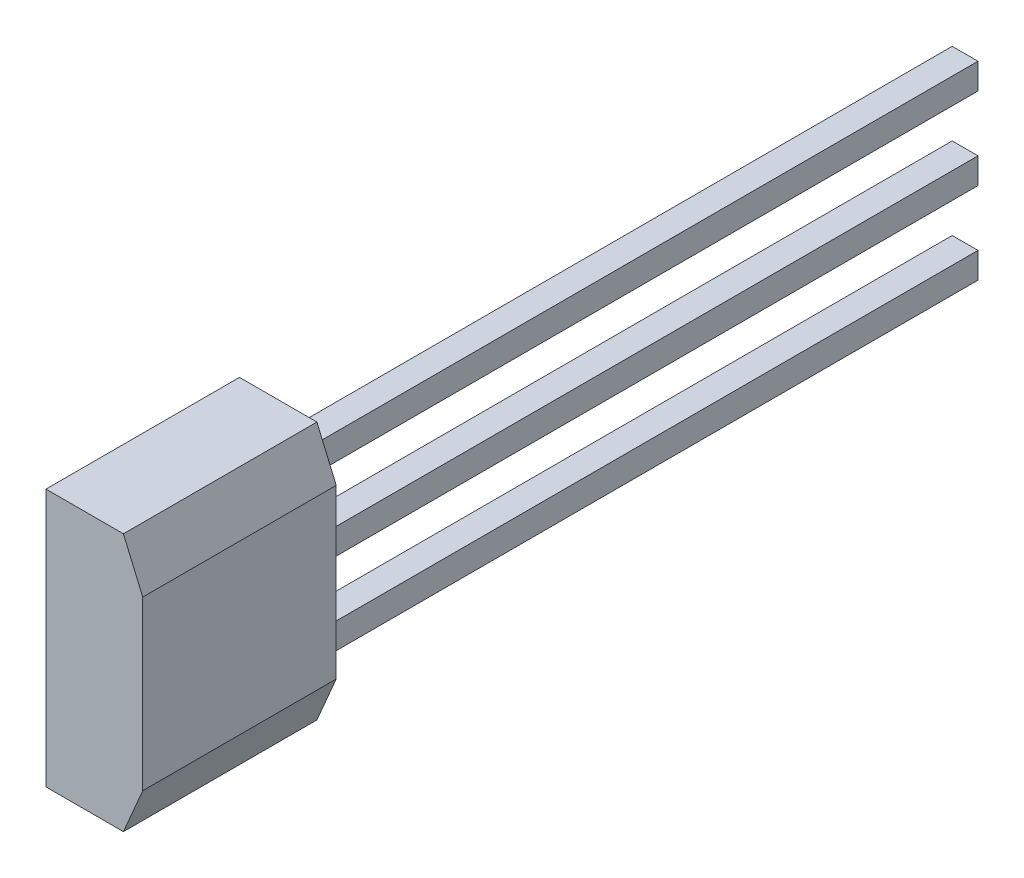
ISO-10303-21;
HEADER;
FILE_DESCRIPTION(('STEP AP214'),'2;1');
FILE_NAME('part.step','',(''),(''),'','','');
FILE_SCHEMA(('AUTOMOTIVE_DESIGN { 1 0 10303 214 1 1 1 1 }'));
ENDSEC;
DATA;
#1=APPLICATION_CONTEXT('core data for automotive mechanical design processes');
#2=APPLICATION_PROTOCOL_DEFINITION('international standard','automotive_design',2000,#1);
#3=PRODUCT_CONTEXT('',#1,'mechanical');
#4=PRODUCT('Part','Part','',(#3));
#5=PRODUCT_RELATED_PRODUCT_CATEGORY('part','',(#4));
#6=PRODUCT_DEFINITION_FORMATION('','',#4);
#7=PRODUCT_DEFINITION_CONTEXT('part definition',#1,'design');
#8=PRODUCT_DEFINITION('design','',#6,#7);
#9=PRODUCT_DEFINITION_SHAPE('','',#8);
#10=(LENGTH_UNIT() NAMED_UNIT(*) SI_UNIT(.MILLI.,.METRE.));
#11=(NAMED_UNIT(*) PLANE_ANGLE_UNIT() SI_UNIT($,.RADIAN.));
#12=(NAMED_UNIT(*) SI_UNIT($,.STERADIAN.) SOLID_ANGLE_UNIT());
#13=UNCERTAINTY_MEASURE_WITH_UNIT(LENGTH_MEASURE(1.E-05),#10,'distance_accuracy_value','');
#14=(GEOMETRIC_REPRESENTATION_CONTEXT(3) GLOBAL_UNCERTAINTY_ASSIGNED_CONTEXT((#13)) GLOBAL_UNIT_ASSIGNED_CONTEXT((#10,
#11,#12)) REPRESENTATION_CONTEXT('',''));
#15=CARTESIAN_POINT('',(0.,0.,0.));
#16=DIRECTION('',(0.,0.,1.));
#17=DIRECTION('',(1.,0.,0.));
#18=AXIS2_PLACEMENT_3D('',#15,#16,#17);
#19=CARTESIAN_POINT('',(-0.2,-10.71699176271,2.21));
#20=DIRECTION('',(-1.,0.,0.));
#21=DIRECTION('',(0.,1.,0.));
#22=AXIS2_PLACEMENT_3D('',#19,#20,#21);
#23=PLANE('',#22);
#24=DIRECTION('',(0.,1.,0.));
#25=VECTOR('',#24,1.);
#26=CARTESIAN_POINT('',(-0.2,-10.5,-8.5));
#27=LINE('',#26,#25);
#28=CARTESIAN_POINT('',(-0.2,-10.7,-8.5));
#29=VERTEX_POINT('',#28);
#30=CARTESIAN_POINT('',(-0.199999999999998,-10.3,-8.5));
#31=VERTEX_POINT('',#30);
#32=EDGE_CURVE('E224',#29,#31,#27,.T.);
#33=ORIENTED_EDGE('',*,*,#32,.F.);
#34=DIRECTION('',(0.,0.,-1.));
#35=VECTOR('',#34,1.);
#36=CARTESIAN_POINT('',(-0.200000000000001,-10.7,-3.25));
#37=LINE('',#36,#35);
#38=CARTESIAN_POINT('',(-0.2,-10.7,2.));
#39=VERTEX_POINT('',#38);
#40=EDGE_CURVE('E217',#39,#29,#37,.T.);
#41=ORIENTED_EDGE('',*,*,#40,.F.);
#42=DIRECTION('',(0.,1.,0.));
#43=VECTOR('',#42,1.);
#44=CARTESIAN_POINT('',(-0.2,-10.5,2.));
#45=LINE('',#44,#43);
#46=CARTESIAN_POINT('',(-0.199999999999998,-10.3,2.));
#47=VERTEX_POINT('',#46);
#48=EDGE_CURVE('E201',#39,#47,#45,.T.);
#49=ORIENTED_EDGE('',*,*,#48,.T.);
#50=DIRECTION('',(0.,0.,1.));
#51=VECTOR('',#50,1.);
#52=CARTESIAN_POINT('',(-0.19999999999999,-10.3,-3.25));
#53=LINE('',#52,#51);
#54=EDGE_CURVE('E233',#31,#47,#53,.T.);
#55=ORIENTED_EDGE('',*,*,#54,.F.);
#56=EDGE_LOOP('',(#33,#41,#49,#55));
#57=FACE_BOUND('',#56,.T.);
#58=ADVANCED_FACE('F17',(#57),#23,.T.);
#59=CARTESIAN_POINT('',(-0.2,-9.44699176271,2.21));
#60=DIRECTION('',(-1.,0.,0.));
#61=DIRECTION('',(0.,1.,0.));
#62=AXIS2_PLACEMENT_3D('',#59,#60,#61);
#63=PLANE('',#62);
#64=DIRECTION('',(0.,1.,0.));
#65=VECTOR('',#64,1.);
#66=CARTESIAN_POINT('',(-0.2,-10.5,-8.5));
#67=LINE('',#66,#65);
#68=CARTESIAN_POINT('',(-0.2,-9.42999999999995,-8.5));
#69=VERTEX_POINT('',#68);
#70=CARTESIAN_POINT('',(-0.199999999999998,-9.03000000000005,-8.5));
#71=VERTEX_POINT('',#70);
#72=EDGE_CURVE('E248',#69,#71,#67,.T.);
#73=ORIENTED_EDGE('',*,*,#72,.F.);
#74=DIRECTION('',(0.,0.,-1.));
#75=VECTOR('',#74,1.);
#76=CARTESIAN_POINT('',(-0.200000000000001,-9.43,-3.25));
#77=LINE('',#76,#75);
#78=CARTESIAN_POINT('',(-0.2,-9.42999999999995,2.));
#79=VERTEX_POINT('',#78);
#80=EDGE_CURVE('E241',#79,#69,#77,.T.);
#81=ORIENTED_EDGE('',*,*,#80,.F.);
#82=DIRECTION('',(0.,1.,0.));
#83=VECTOR('',#82,1.);
#84=CARTESIAN_POINT('',(-0.2,-9.23,2.));
#85=LINE('',#84,#83);
#86=CARTESIAN_POINT('',(-0.199999999999998,-9.03000000000005,2.));
#87=VERTEX_POINT('',#86);
#88=EDGE_CURVE('E205',#79,#87,#85,.T.);
#89=ORIENTED_EDGE('',*,*,#88,.T.);
#90=DIRECTION('',(0.,0.,1.));
#91=VECTOR('',#90,1.);
#92=CARTESIAN_POINT('',(-0.19999999999999,-9.03,-3.25));
#93=LINE('',#92,#91);
#94=EDGE_CURVE('E258',#71,#87,#93,.T.);
#95=ORIENTED_EDGE('',*,*,#94,.F.);
#96=EDGE_LOOP('',(#73,#81,#89,#95));
#97=FACE_BOUND('',#96,.T.);
#98=ADVANCED_FACE('F563',(#97),#63,.T.);
#99=CARTESIAN_POINT('',(-0.2,-11.98699176271,2.21));
#100=DIRECTION('',(-1.,0.,0.));
#101=DIRECTION('',(0.,1.,0.));
#102=AXIS2_PLACEMENT_3D('',#99,#100,#101);
#103=PLANE('',#102);
#104=DIRECTION('',(0.,1.,0.));
#105=VECTOR('',#104,1.);
#106=CARTESIAN_POINT('',(-0.2,-10.5,-8.5));
#107=LINE('',#106,#105);
#108=CARTESIAN_POINT('',(-0.2,-11.97,-8.5));
#109=VERTEX_POINT('',#108);
#110=CARTESIAN_POINT('',(-0.199999999999998,-11.57,-8.5));
#111=VERTEX_POINT('',#110);
#112=EDGE_CURVE('E272',#109,#111,#107,.T.);
#113=ORIENTED_EDGE('',*,*,#112,.F.);
#114=DIRECTION('',(0.,0.,-1.));
#115=VECTOR('',#114,1.);
#116=CARTESIAN_POINT('',(-0.200000000000001,-11.97,-3.25));
#117=LINE('',#116,#115);
#118=CARTESIAN_POINT('',(-0.2,-11.97,2.));
#119=VERTEX_POINT('',#118);
#120=EDGE_CURVE('E266',#119,#109,#117,.T.);
#121=ORIENTED_EDGE('',*,*,#120,.F.);
#122=DIRECTION('',(0.,1.,0.));
#123=VECTOR('',#122,1.);
#124=CARTESIAN_POINT('',(-0.2,-11.77,2.));
#125=LINE('',#124,#123);
#126=CARTESIAN_POINT('',(-0.199999999999998,-11.57,2.));
#127=VERTEX_POINT('',#126);
#128=EDGE_CURVE('E209',#119,#127,#125,.T.);
#129=ORIENTED_EDGE('',*,*,#128,.T.);
#130=DIRECTION('',(0.,0.,1.));
#131=VECTOR('',#130,1.);
#132=CARTESIAN_POINT('',(-0.19999999999999,-11.57,-3.25));
#133=LINE('',#132,#131);
#134=EDGE_CURVE('E282',#111,#127,#133,.T.);
#135=ORIENTED_EDGE('',*,*,#134,.F.);
#136=EDGE_LOOP('',(#113,#121,#129,#135));
#137=FACE_BOUND('',#136,.T.);
#138=ADVANCED_FACE('F553',(#137),#103,.T.);
#139=CARTESIAN_POINT('',(0.2169917627102,-10.7,2.21));
#140=DIRECTION('',(0.,-1.,0.));
#141=DIRECTION('',(-1.,0.,0.));
#142=AXIS2_PLACEMENT_3D('',#139,#140,#141);
#143=PLANE('',#142);
#144=DIRECTION('',(-1.,0.,0.));
#145=VECTOR('',#144,1.);
#146=CARTESIAN_POINT('',(0.,-10.7,-8.5));
#147=LINE('',#146,#145);
#148=CARTESIAN_POINT('',(0.199999999999995,-10.7,-8.5));
#149=VERTEX_POINT('',#148);
#150=EDGE_CURVE('E220',#149,#29,#147,.T.);
#151=ORIENTED_EDGE('',*,*,#150,.F.);
#152=DIRECTION('',(0.,0.,-1.));
#153=VECTOR('',#152,1.);
#154=CARTESIAN_POINT('',(0.2,-10.6999999999998,-3.25));
#155=LINE('',#154,#153);
#156=CARTESIAN_POINT('',(0.199999999999995,-10.7,2.));
#157=VERTEX_POINT('',#156);
#158=EDGE_CURVE('E286',#157,#149,#155,.T.);
#159=ORIENTED_EDGE('',*,*,#158,.F.);
#160=DIRECTION('',(-1.,0.,0.));
#161=VECTOR('',#160,1.);
#162=CARTESIAN_POINT('',(0.,-10.7,2.));
#163=LINE('',#162,#161);
#164=EDGE_CURVE('E213',#157,#39,#163,.T.);
#165=ORIENTED_EDGE('',*,*,#164,.T.);
#166=ORIENTED_EDGE('',*,*,#40,.T.);
#167=EDGE_LOOP('',(#151,#159,#165,#166));
#168=FACE_BOUND('',#167,.T.);
#169=ADVANCED_FACE('F543',(#168),#143,.T.);
#170=CARTESIAN_POINT('',(0.2169917627102,-12.0288,-8.5));
#171=DIRECTION('',(0.,0.,-1.));
#172=DIRECTION('',(-1.,0.,0.));
#173=AXIS2_PLACEMENT_3D('',#170,#171,#172);
#174=PLANE('',#173);
#175=DIRECTION('',(-1.,0.,0.));
#176=VECTOR('',#175,1.);
#177=CARTESIAN_POINT('',(0.,-10.3,-8.5));
#178=LINE('',#177,#176);
#179=CARTESIAN_POINT('',(0.2,-10.3,-8.5));
#180=VERTEX_POINT('',#179);
#181=EDGE_CURVE('E229',#180,#31,#178,.T.);
#182=ORIENTED_EDGE('',*,*,#181,.F.);
#183=DIRECTION('',(0.,1.,0.));
#184=VECTOR('',#183,1.);
#185=CARTESIAN_POINT('',(0.2,-10.5,-8.5));
#186=LINE('',#185,#184);
#187=EDGE_CURVE('E290',#149,#180,#186,.T.);
#188=ORIENTED_EDGE('',*,*,#187,.F.);
#189=ORIENTED_EDGE('',*,*,#150,.T.);
#190=ORIENTED_EDGE('',*,*,#32,.T.);
#191=EDGE_LOOP('',(#182,#188,#189,#190));
#192=FACE_BOUND('',#191,.T.);
#193=ADVANCED_FACE('F533',(#192),#174,.T.);
#194=CARTESIAN_POINT('',(-0.2169917627102,-10.3,2.21));
#195=DIRECTION('',(0.,1.,0.));
#196=DIRECTION('',(1.,0.,0.));
#197=AXIS2_PLACEMENT_3D('',#194,#195,#196);
#198=PLANE('',#197);
#199=ORIENTED_EDGE('',*,*,#181,.T.);
#200=ORIENTED_EDGE('',*,*,#54,.T.);
#201=DIRECTION('',(1.,0.,0.));
#202=VECTOR('',#201,1.);
#203=CARTESIAN_POINT('',(0.,-10.3,2.));
#204=LINE('',#203,#202);
#205=CARTESIAN_POINT('',(0.2,-10.3,2.));
#206=VERTEX_POINT('',#205);
#207=EDGE_CURVE('E227',#47,#206,#204,.T.);
#208=ORIENTED_EDGE('',*,*,#207,.T.);
#209=DIRECTION('',(0.,0.,1.));
#210=VECTOR('',#209,1.);
#211=CARTESIAN_POINT('',(0.2,-10.3000000000002,-3.25));
#212=LINE('',#211,#210);
#213=EDGE_CURVE('E294',#180,#206,#212,.T.);
#214=ORIENTED_EDGE('',*,*,#213,.F.);
#215=EDGE_LOOP('',(#199,#200,#208,#214));
#216=FACE_BOUND('',#215,.T.);
#217=ADVANCED_FACE('F523',(#216),#198,.T.);
#218=CARTESIAN_POINT('',(0.2169917627102,-9.43,2.21));
#219=DIRECTION('',(0.,-1.,0.));
#220=DIRECTION('',(-1.,0.,0.));
#221=AXIS2_PLACEMENT_3D('',#218,#219,#220);
#222=PLANE('',#221);
#223=DIRECTION('',(-1.,0.,0.));
#224=VECTOR('',#223,1.);
#225=CARTESIAN_POINT('',(0.,-9.43,-8.5));
#226=LINE('',#225,#224);
#227=CARTESIAN_POINT('',(0.199999999999995,-9.42999999999995,-8.5));
#228=VERTEX_POINT('',#227);
#229=EDGE_CURVE('E244',#228,#69,#226,.T.);
#230=ORIENTED_EDGE('',*,*,#229,.F.);
#231=DIRECTION('',(0.,0.,-1.));
#232=VECTOR('',#231,1.);
#233=CARTESIAN_POINT('',(0.2,-9.42999999999981,-3.25));
#234=LINE('',#233,#232);
#235=CARTESIAN_POINT('',(0.199999999999995,-9.42999999999995,2.));
#236=VERTEX_POINT('',#235);
#237=EDGE_CURVE('E298',#236,#228,#234,.T.);
#238=ORIENTED_EDGE('',*,*,#237,.F.);
#239=DIRECTION('',(-1.,0.,0.));
#240=VECTOR('',#239,1.);
#241=CARTESIAN_POINT('',(0.,-9.43,2.));
#242=LINE('',#241,#240);
#243=EDGE_CURVE('E237',#236,#79,#242,.T.);
#244=ORIENTED_EDGE('',*,*,#243,.T.);
#245=ORIENTED_EDGE('',*,*,#80,.T.);
#246=EDGE_LOOP('',(#230,#238,#244,#245));
#247=FACE_BOUND('',#246,.T.);
#248=ADVANCED_FACE('F513',(#247),#222,.T.);
#249=CARTESIAN_POINT('',(0.2169917627102,-12.0288,-8.5));
#250=DIRECTION('',(0.,0.,-1.));
#251=DIRECTION('',(-1.,0.,0.));
#252=AXIS2_PLACEMENT_3D('',#249,#250,#251);
#253=PLANE('',#252);
#254=DIRECTION('',(-1.,0.,0.));
#255=VECTOR('',#254,1.);
#256=CARTESIAN_POINT('',(0.,-9.03,-8.5));
#257=LINE('',#256,#255);
#258=CARTESIAN_POINT('',(0.2,-9.03000000000005,-8.5));
#259=VERTEX_POINT('',#258);
#260=EDGE_CURVE('E254',#259,#71,#257,.T.);
#261=ORIENTED_EDGE('',*,*,#260,.F.);
#262=DIRECTION('',(0.,1.,0.));
#263=VECTOR('',#262,1.);
#264=CARTESIAN_POINT('',(0.2,-9.23,-8.5));
#265=LINE('',#264,#263);
#266=EDGE_CURVE('E301',#228,#259,#265,.T.);
#267=ORIENTED_EDGE('',*,*,#266,.F.);
#268=ORIENTED_EDGE('',*,*,#229,.T.);
#269=ORIENTED_EDGE('',*,*,#72,.T.);
#270=EDGE_LOOP('',(#261,#267,#268,#269));
#271=FACE_BOUND('',#270,.T.);
#272=ADVANCED_FACE('F503',(#271),#253,.T.);
#273=CARTESIAN_POINT('',(-0.2169917627102,-9.03,2.21));
#274=DIRECTION('',(0.,1.,0.));
#275=DIRECTION('',(1.,0.,0.));
#276=AXIS2_PLACEMENT_3D('',#273,#274,#275);
#277=PLANE('',#276);
#278=ORIENTED_EDGE('',*,*,#260,.T.);
#279=ORIENTED_EDGE('',*,*,#94,.T.);
#280=DIRECTION('',(1.,0.,0.));
#281=VECTOR('',#280,1.);
#282=CARTESIAN_POINT('',(0.,-9.03,2.));
#283=LINE('',#282,#281);
#284=CARTESIAN_POINT('',(0.2,-9.03000000000005,2.));
#285=VERTEX_POINT('',#284);
#286=EDGE_CURVE('E251',#87,#285,#283,.T.);
#287=ORIENTED_EDGE('',*,*,#286,.T.);
#288=DIRECTION('',(0.,0.,1.));
#289=VECTOR('',#288,1.);
#290=CARTESIAN_POINT('',(0.2,-9.03000000000019,-3.25));
#291=LINE('',#290,#289);
#292=EDGE_CURVE('E305',#259,#285,#291,.T.);
#293=ORIENTED_EDGE('',*,*,#292,.F.);
#294=EDGE_LOOP('',(#278,#279,#287,#293));
#295=FACE_BOUND('',#294,.T.);
#296=ADVANCED_FACE('F493',(#295),#277,.T.);
#297=CARTESIAN_POINT('',(0.2169917627102,-11.97,2.21));
#298=DIRECTION('',(0.,-1.,0.));
#299=DIRECTION('',(-1.,0.,0.));
#300=AXIS2_PLACEMENT_3D('',#297,#298,#299);
#301=PLANE('',#300);
#302=DIRECTION('',(-1.,0.,0.));
#303=VECTOR('',#302,1.);
#304=CARTESIAN_POINT('',(0.,-11.97,-8.5));
#305=LINE('',#304,#303);
#306=CARTESIAN_POINT('',(0.199999999999995,-11.97,-8.5));
#307=VERTEX_POINT('',#306);
#308=EDGE_CURVE('E269',#307,#109,#305,.T.);
#309=ORIENTED_EDGE('',*,*,#308,.F.);
#310=DIRECTION('',(0.,0.,-1.));
#311=VECTOR('',#310,1.);
#312=CARTESIAN_POINT('',(0.2,-11.9699999999998,-3.25));
#313=LINE('',#312,#311);
#314=CARTESIAN_POINT('',(0.199999999999995,-11.97,2.));
#315=VERTEX_POINT('',#314);
#316=EDGE_CURVE('E309',#315,#307,#313,.T.);
#317=ORIENTED_EDGE('',*,*,#316,.F.);
#318=DIRECTION('',(-1.,0.,0.));
#319=VECTOR('',#318,1.);
#320=CARTESIAN_POINT('',(0.,-11.97,2.));
#321=LINE('',#320,#319);
#322=EDGE_CURVE('E262',#315,#119,#321,.T.);
#323=ORIENTED_EDGE('',*,*,#322,.T.);
#324=ORIENTED_EDGE('',*,*,#120,.T.);
#325=EDGE_LOOP('',(#309,#317,#323,#324));
#326=FACE_BOUND('',#325,.T.);
#327=ADVANCED_FACE('F483',(#326),#301,.T.);
#328=CARTESIAN_POINT('',(0.2169917627102,-12.0288,-8.5));
#329=DIRECTION('',(0.,0.,-1.));
#330=DIRECTION('',(-1.,0.,0.));
#331=AXIS2_PLACEMENT_3D('',#328,#329,#330);
#332=PLANE('',#331);
#333=DIRECTION('',(-1.,0.,0.));
#334=VECTOR('',#333,1.);
#335=CARTESIAN_POINT('',(0.,-11.57,-8.5));
#336=LINE('',#335,#334);
#337=CARTESIAN_POINT('',(0.2,-11.57,-8.5));
#338=VERTEX_POINT('',#337);
#339=EDGE_CURVE('E278',#338,#111,#336,.T.);
#340=ORIENTED_EDGE('',*,*,#339,.F.);
#341=DIRECTION('',(0.,1.,0.));
#342=VECTOR('',#341,1.);
#343=CARTESIAN_POINT('',(0.2,-11.77,-8.5));
#344=LINE('',#343,#342);
#345=EDGE_CURVE('E313',#307,#338,#344,.T.);
#346=ORIENTED_EDGE('',*,*,#345,.F.);
#347=ORIENTED_EDGE('',*,*,#308,.T.);
#348=ORIENTED_EDGE('',*,*,#112,.T.);
#349=EDGE_LOOP('',(#340,#346,#347,#348));
#350=FACE_BOUND('',#349,.T.);
#351=ADVANCED_FACE('F473',(#350),#332,.T.);
#352=CARTESIAN_POINT('',(-0.2169917627102,-11.57,2.21));
#353=DIRECTION('',(0.,1.,0.));
#354=DIRECTION('',(1.,0.,0.));
#355=AXIS2_PLACEMENT_3D('',#352,#353,#354);
#356=PLANE('',#355);
#357=ORIENTED_EDGE('',*,*,#339,.T.);
#358=ORIENTED_EDGE('',*,*,#134,.T.);
#359=DIRECTION('',(1.,0.,0.));
#360=VECTOR('',#359,1.);
#361=CARTESIAN_POINT('',(0.,-11.57,2.));
#362=LINE('',#361,#360);
#363=CARTESIAN_POINT('',(0.2,-11.57,2.));
#364=VERTEX_POINT('',#363);
#365=EDGE_CURVE('E275',#127,#364,#362,.T.);
#366=ORIENTED_EDGE('',*,*,#365,.T.);
#367=DIRECTION('',(0.,0.,1.));
#368=VECTOR('',#367,1.);
#369=CARTESIAN_POINT('',(0.2,-11.5700000000002,-3.25));
#370=LINE('',#369,#368);
#371=EDGE_CURVE('E317',#338,#364,#370,.T.);
#372=ORIENTED_EDGE('',*,*,#371,.F.);
#373=EDGE_LOOP('',(#357,#358,#366,#372));
#374=FACE_BOUND('',#373,.T.);
#375=ADVANCED_FACE('F463',(#374),#356,.T.);
#376=CARTESIAN_POINT('',(0.2,-10.28300823729,2.21));
#377=DIRECTION('',(1.,0.,0.));
#378=DIRECTION('',(0.,-1.,0.));
#379=AXIS2_PLACEMENT_3D('',#376,#377,#378);
#380=PLANE('',#379);
#381=ORIENTED_EDGE('',*,*,#187,.T.);
#382=ORIENTED_EDGE('',*,*,#213,.T.);
#383=DIRECTION('',(0.,-1.,0.));
#384=VECTOR('',#383,1.);
#385=CARTESIAN_POINT('',(0.2,-10.5,2.));
#386=LINE('',#385,#384);
#387=EDGE_CURVE('E186',#206,#157,#386,.T.);
#388=ORIENTED_EDGE('',*,*,#387,.T.);
#389=ORIENTED_EDGE('',*,*,#158,.T.);
#390=EDGE_LOOP('',(#381,#382,#388,#389));
#391=FACE_BOUND('',#390,.T.);
#392=ADVANCED_FACE('F453',(#391),#380,.T.);
#393=CARTESIAN_POINT('',(0.2,-9.01300823729,2.21));
#394=DIRECTION('',(1.,0.,0.));
#395=DIRECTION('',(0.,-1.,0.));
#396=AXIS2_PLACEMENT_3D('',#393,#394,#395);
#397=PLANE('',#396);
#398=ORIENTED_EDGE('',*,*,#266,.T.);
#399=ORIENTED_EDGE('',*,*,#292,.T.);
#400=DIRECTION('',(0.,-1.,0.));
#401=VECTOR('',#400,1.);
#402=CARTESIAN_POINT('',(0.2,-10.5,2.));
#403=LINE('',#402,#401);
#404=EDGE_CURVE('E192',#285,#236,#403,.T.);
#405=ORIENTED_EDGE('',*,*,#404,.T.);
#406=ORIENTED_EDGE('',*,*,#237,.T.);
#407=EDGE_LOOP('',(#398,#399,#405,#406));
#408=FACE_BOUND('',#407,.T.);
#409=ADVANCED_FACE('F362',(#408),#397,.T.);
#410=CARTESIAN_POINT('',(0.2,-11.55300823729,2.21));
#411=DIRECTION('',(1.,0.,0.));
#412=DIRECTION('',(0.,-1.,0.));
#413=AXIS2_PLACEMENT_3D('',#410,#411,#412);
#414=PLANE('',#413);
#415=ORIENTED_EDGE('',*,*,#345,.T.);
#416=ORIENTED_EDGE('',*,*,#371,.T.);
#417=DIRECTION('',(0.,-1.,0.));
#418=VECTOR('',#417,1.);
#419=CARTESIAN_POINT('',(0.2,-10.5,2.));
#420=LINE('',#419,#418);
#421=EDGE_CURVE('E332',#364,#315,#420,.T.);
#422=ORIENTED_EDGE('',*,*,#421,.T.);
#423=ORIENTED_EDGE('',*,*,#316,.T.);
#424=EDGE_LOOP('',(#415,#416,#422,#423));
#425=FACE_BOUND('',#424,.T.);
#426=ADVANCED_FACE('F354',(#425),#414,.T.);
#427=CARTESIAN_POINT('',(0.474,-8.5,1.94));
#428=DIRECTION('',(0.,1.,0.));
#429=DIRECTION('',(-1.,0.,0.));
#430=AXIS2_PLACEMENT_3D('',#427,#428,#429);
#431=PLANE('',#430);
#432=DIRECTION('',(0.,0.,-1.));
#433=VECTOR('',#432,1.);
#434=CARTESIAN_POINT('',(-0.75,-8.5,3.5));
#435=LINE('',#434,#433);
#436=CARTESIAN_POINT('',(-0.75,-8.5,5.));
#437=VERTEX_POINT('',#436);
#438=CARTESIAN_POINT('',(-0.75,-8.5,2.));
#439=VERTEX_POINT('',#438);
#440=EDGE_CURVE('E335',#437,#439,#435,.T.);
#441=ORIENTED_EDGE('',*,*,#440,.F.);
#442=DIRECTION('',(1.,0.,0.));
#443=VECTOR('',#442,1.);
#444=CARTESIAN_POINT('',(-0.15,-8.5,5.));
#445=LINE('',#444,#443);
#446=CARTESIAN_POINT('',(0.450000000000006,-8.50000000000008,5.));
#447=VERTEX_POINT('',#446);
#448=EDGE_CURVE('E321',#437,#447,#445,.T.);
#449=ORIENTED_EDGE('',*,*,#448,.T.);
#450=DIRECTION('',(0.,0.,1.));
#451=VECTOR('',#450,1.);
#452=CARTESIAN_POINT('',(0.450000000000025,-8.50000000000031,3.5));
#453=LINE('',#452,#451);
#454=CARTESIAN_POINT('',(0.449999999999958,-8.50000000000016,2.));
#455=VERTEX_POINT('',#454);
#456=EDGE_CURVE('E178',#455,#447,#453,.T.);
#457=ORIENTED_EDGE('',*,*,#456,.F.);
#458=DIRECTION('',(-1.,0.,0.));
#459=VECTOR('',#458,1.);
#460=CARTESIAN_POINT('',(0.,-8.5,2.));
#461=LINE('',#460,#459);
#462=EDGE_CURVE('E161',#455,#439,#461,.T.);
#463=ORIENTED_EDGE('',*,*,#462,.T.);
#464=EDGE_LOOP('',(#441,#449,#457,#463));
#465=FACE_BOUND('',#464,.T.);
#466=ADVANCED_FACE('F351',(#465),#431,.T.);
#467=CARTESIAN_POINT('',(-0.774,-12.5,1.94));
#468=DIRECTION('',(0.,-1.,0.));
#469=DIRECTION('',(1.,0.,0.));
#470=AXIS2_PLACEMENT_3D('',#467,#468,#469);
#471=PLANE('',#470);
#472=DIRECTION('',(0.,0.,1.));
#473=VECTOR('',#472,1.);
#474=CARTESIAN_POINT('',(-0.75,-12.5,3.5));
#475=LINE('',#474,#473);
#476=CARTESIAN_POINT('',(-0.75,-12.5,2.));
#477=VERTEX_POINT('',#476);
#478=CARTESIAN_POINT('',(-0.75,-12.5,5.));
#479=VERTEX_POINT('',#478);
#480=EDGE_CURVE('E152',#477,#479,#475,.T.);
#481=ORIENTED_EDGE('',*,*,#480,.F.);
#482=DIRECTION('',(1.,0.,0.));
#483=VECTOR('',#482,1.);
#484=CARTESIAN_POINT('',(0.,-12.5,2.));
#485=LINE('',#484,#483);
#486=CARTESIAN_POINT('',(0.450000000000778,-12.5000000000018,2.));
#487=VERTEX_POINT('',#486);
#488=EDGE_CURVE('E183',#477,#487,#485,.T.);
#489=ORIENTED_EDGE('',*,*,#488,.T.);
#490=DIRECTION('',(0.,0.,-1.));
#491=VECTOR('',#490,1.);
#492=CARTESIAN_POINT('',(0.450000000000025,-12.5000000000035,3.5));
#493=LINE('',#492,#491);
#494=CARTESIAN_POINT('',(0.450000000000006,-12.5000000000009,5.));
#495=VERTEX_POINT('',#494);
#496=EDGE_CURVE('E163',#495,#487,#493,.T.);
#497=ORIENTED_EDGE('',*,*,#496,.F.);
#498=DIRECTION('',(-1.,0.,0.));
#499=VECTOR('',#498,1.);
#500=CARTESIAN_POINT('',(-0.15,-12.5,5.));
#501=LINE('',#500,#499);
#502=EDGE_CURVE('E181',#495,#479,#501,.T.);
#503=ORIENTED_EDGE('',*,*,#502,.T.);
#504=EDGE_LOOP('',(#481,#489,#497,#503));
#505=FACE_BOUND('',#504,.T.);
#506=ADVANCED_FACE('F353',(#505),#471,.T.);
#507=CARTESIAN_POINT('',(0.4433066167516,-8.484382105754,5.06));
#508=DIRECTION('',(0.919145030017955,0.393919298579409,0.));
#509=DIRECTION('',(0.393919298579409,-0.919145030017955,0.));
#510=AXIS2_PLACEMENT_3D('',#507,#508,#509);
#511=PLANE('',#510);
#512=DIRECTION('',(0.393919298579409,-0.919145030017954,0.));
#513=VECTOR('',#512,1.);
#514=CARTESIAN_POINT('',(0.6,-8.85,5.));
#515=LINE('',#514,#513);
#516=CARTESIAN_POINT('',(0.749999999999988,-9.19999999999984,5.));
#517=VERTEX_POINT('',#516);
#518=EDGE_CURVE('E146',#447,#517,#515,.T.);
#519=ORIENTED_EDGE('',*,*,#518,.T.);
#520=DIRECTION('',(0.,0.,1.));
#521=VECTOR('',#520,1.);
#522=CARTESIAN_POINT('',(0.75,-9.2,3.5));
#523=LINE('',#522,#521);
#524=CARTESIAN_POINT('',(0.75,-9.19999999999987,2.));
#525=VERTEX_POINT('',#524);
#526=EDGE_CURVE('E140',#525,#517,#523,.T.);
#527=ORIENTED_EDGE('',*,*,#526,.F.);
#528=DIRECTION('',(0.393919298579409,-0.919145030017955,0.));
#529=VECTOR('',#528,1.);
#530=CARTESIAN_POINT('',(0.4433066167516,-8.484382105754,2.));
#531=LINE('',#530,#529);
#532=EDGE_CURVE('E21',#525,#455,#531,.F.);
#533=ORIENTED_EDGE('',*,*,#532,.T.);
#534=ORIENTED_EDGE('',*,*,#456,.T.);
#535=EDGE_LOOP('',(#519,#527,#533,#534));
#536=FACE_BOUND('',#535,.T.);
#537=ADVANCED_FACE('F142',(#536),#511,.T.);
#538=CARTESIAN_POINT('',(0.7566933832484,-11.78438210575,5.06));
#539=DIRECTION('',(0.919145030019514,-0.39391929857577,0.));
#540=DIRECTION('',(-0.39391929857577,-0.919145030019514,0.));
#541=AXIS2_PLACEMENT_3D('',#538,#539,#540);
#542=PLANE('',#541);
#543=DIRECTION('',(-0.39391929857577,-0.919145030019514,0.));
#544=VECTOR('',#543,1.);
#545=CARTESIAN_POINT('',(0.6,-12.15,5.));
#546=LINE('',#545,#544);
#547=CARTESIAN_POINT('',(0.749999999999988,-11.7999999999982,5.));
#548=VERTEX_POINT('',#547);
#549=EDGE_CURVE('E36',#548,#495,#546,.T.);
#550=ORIENTED_EDGE('',*,*,#549,.T.);
#551=ORIENTED_EDGE('',*,*,#496,.T.);
#552=DIRECTION('',(-0.39391929857577,-0.919145030019514,0.));
#553=VECTOR('',#552,1.);
#554=CARTESIAN_POINT('',(0.7566933832484,-11.78438210575,2.));
#555=LINE('',#554,#553);
#556=CARTESIAN_POINT('',(0.75,-11.7999999999982,2.));
#557=VERTEX_POINT('',#556);
#558=EDGE_CURVE('E184',#487,#557,#555,.F.);
#559=ORIENTED_EDGE('',*,*,#558,.T.);
#560=DIRECTION('',(0.,0.,-1.));
#561=VECTOR('',#560,1.);
#562=CARTESIAN_POINT('',(0.75,-11.8,3.5));
#563=LINE('',#562,#561);
#564=EDGE_CURVE('E151',#548,#557,#563,.T.);
#565=ORIENTED_EDGE('',*,*,#564,.F.);
#566=EDGE_LOOP('',(#550,#551,#559,#565));
#567=FACE_BOUND('',#566,.T.);
#568=ADVANCED_FACE('F376',(#567),#542,.T.);
#569=CARTESIAN_POINT('',(-0.78,-12.58,2.));
#570=DIRECTION('',(0.,0.,1.));
#571=DIRECTION('',(1.,0.,0.));
#572=AXIS2_PLACEMENT_3D('',#569,#570,#571);
#573=PLANE('',#572);
#574=ORIENTED_EDGE('',*,*,#365,.F.);
#575=ORIENTED_EDGE('',*,*,#128,.F.);
#576=ORIENTED_EDGE('',*,*,#322,.F.);
#577=ORIENTED_EDGE('',*,*,#421,.F.);
#578=EDGE_LOOP('',(#574,#575,#576,#577));
#579=FACE_BOUND('',#578,.T.);
#580=ORIENTED_EDGE('',*,*,#286,.F.);
#581=ORIENTED_EDGE('',*,*,#88,.F.);
#582=ORIENTED_EDGE('',*,*,#243,.F.);
#583=ORIENTED_EDGE('',*,*,#404,.F.);
#584=EDGE_LOOP('',(#580,#581,#582,#583));
#585=FACE_BOUND('',#584,.T.);
#586=ORIENTED_EDGE('',*,*,#207,.F.);
#587=ORIENTED_EDGE('',*,*,#48,.F.);
#588=ORIENTED_EDGE('',*,*,#164,.F.);
#589=ORIENTED_EDGE('',*,*,#387,.F.);
#590=EDGE_LOOP('',(#586,#587,#588,#589));
#591=FACE_BOUND('',#590,.T.);
#592=ORIENTED_EDGE('',*,*,#558,.F.);
#593=ORIENTED_EDGE('',*,*,#488,.F.);
#594=DIRECTION('',(0.,-1.,0.));
#595=VECTOR('',#594,1.);
#596=CARTESIAN_POINT('',(-0.75,-10.5,2.));
#597=LINE('',#596,#595);
#598=EDGE_CURVE('E339',#439,#477,#597,.T.);
#599=ORIENTED_EDGE('',*,*,#598,.F.);
#600=ORIENTED_EDGE('',*,*,#462,.F.);
#601=ORIENTED_EDGE('',*,*,#532,.F.);
#602=DIRECTION('',(0.,1.,0.));
#603=VECTOR('',#602,1.);
#604=CARTESIAN_POINT('',(0.75,-10.5,2.));
#605=LINE('',#604,#603);
#606=EDGE_CURVE('E158',#557,#525,#605,.T.);
#607=ORIENTED_EDGE('',*,*,#606,.F.);
#608=EDGE_LOOP('',(#592,#593,#599,#600,#601,#607));
#609=FACE_BOUND('',#608,.T.);
#610=ADVANCED_FACE('F157',(#579,#585,#591,#609),#573,.F.);
#611=CARTESIAN_POINT('',(-0.75,-8.42,1.94));
#612=DIRECTION('',(-1.,0.,0.));
#613=DIRECTION('',(0.,-1.,0.));
#614=AXIS2_PLACEMENT_3D('',#611,#612,#613);
#615=PLANE('',#614);
#616=ORIENTED_EDGE('',*,*,#598,.T.);
#617=ORIENTED_EDGE('',*,*,#480,.T.);
#618=DIRECTION('',(0.,-1.,0.));
#619=VECTOR('',#618,1.);
#620=CARTESIAN_POINT('',(-0.75,-10.5,5.));
#621=LINE('',#620,#619);
#622=EDGE_CURVE('E28',#437,#479,#621,.T.);
#623=ORIENTED_EDGE('',*,*,#622,.F.);
#624=ORIENTED_EDGE('',*,*,#440,.T.);
#625=EDGE_LOOP('',(#616,#617,#623,#624));
#626=FACE_BOUND('',#625,.T.);
#627=ADVANCED_FACE('F347',(#626),#615,.T.);
#628=CARTESIAN_POINT('',(0.75,-11.852,1.94));
#629=DIRECTION('',(1.,0.,0.));
#630=DIRECTION('',(0.,1.,0.));
#631=AXIS2_PLACEMENT_3D('',#628,#629,#630);
#632=PLANE('',#631);
#633=ORIENTED_EDGE('',*,*,#564,.T.);
#634=ORIENTED_EDGE('',*,*,#606,.T.);
#635=ORIENTED_EDGE('',*,*,#526,.T.);
#636=DIRECTION('',(0.,1.,0.));
#637=VECTOR('',#636,1.);
#638=CARTESIAN_POINT('',(0.75,-10.5,5.));
#639=LINE('',#638,#637);
#640=EDGE_CURVE('E11',#548,#517,#639,.T.);
#641=ORIENTED_EDGE('',*,*,#640,.F.);
#642=EDGE_LOOP('',(#633,#634,#635,#641));
#643=FACE_BOUND('',#642,.T.);
#644=ADVANCED_FACE('F164',(#643),#632,.T.);
#645=CARTESIAN_POINT('',(-0.78,-12.58,5.));
#646=DIRECTION('',(0.,0.,1.));
#647=DIRECTION('',(1.,0.,0.));
#648=AXIS2_PLACEMENT_3D('',#645,#646,#647);
#649=PLANE('',#648);
#650=ORIENTED_EDGE('',*,*,#549,.F.);
#651=ORIENTED_EDGE('',*,*,#640,.T.);
#652=ORIENTED_EDGE('',*,*,#518,.F.);
#653=ORIENTED_EDGE('',*,*,#448,.F.);
#654=ORIENTED_EDGE('',*,*,#622,.T.);
#655=ORIENTED_EDGE('',*,*,#502,.F.);
#656=EDGE_LOOP('',(#650,#651,#652,#653,#654,#655));
#657=FACE_BOUND('',#656,.T.);
#658=ADVANCED_FACE('F19',(#657),#649,.T.);
#659=CLOSED_SHELL('',(#58,#98,#138,#169,#193,#217,#248,#272,#296,#327,#351,#375,#392,#409,#426,
#466,#506,#537,#568,#610,#627,#644,#658));
#660=MANIFOLD_SOLID_BREP('B1',#659);
#661=ADVANCED_BREP_SHAPE_REPRESENTATION('',(#18,#660),#14);
#662=SHAPE_DEFINITION_REPRESENTATION(#9,#661);
ENDSEC;
END-ISO-10303-21;
